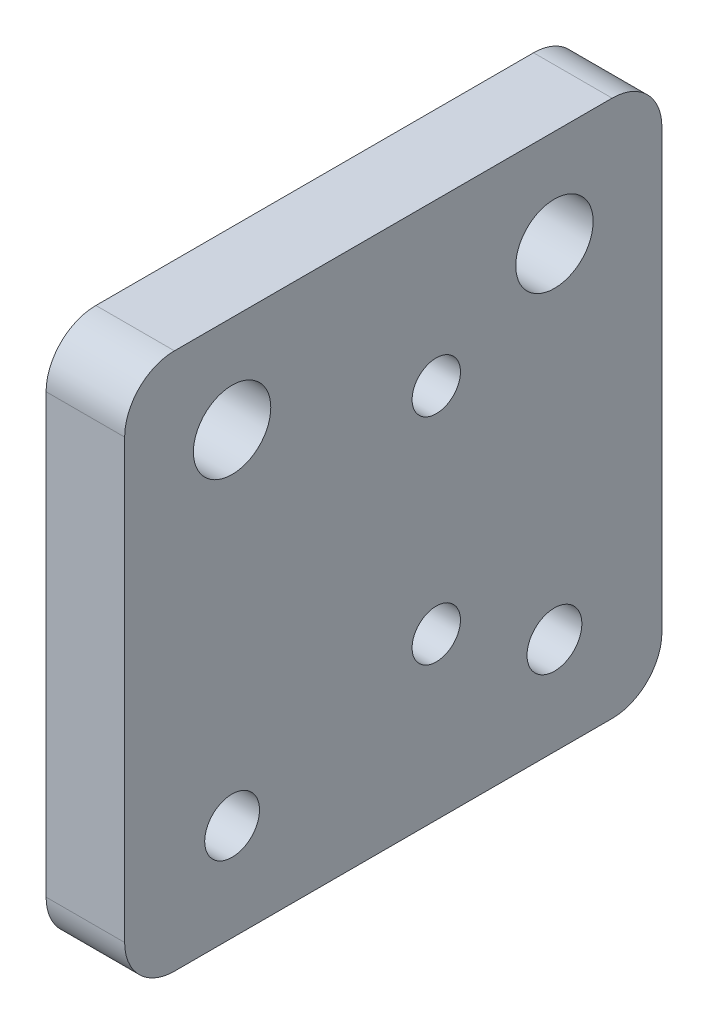
ISO-10303-21;
HEADER;
FILE_DESCRIPTION(('STEP AP214'),'2;1');
FILE_NAME('part.step','',(''),(''),'','','');
FILE_SCHEMA(('AUTOMOTIVE_DESIGN { 1 0 10303 214 1 1 1 1 }'));
ENDSEC;
DATA;
#1=APPLICATION_CONTEXT('core data for automotive mechanical design processes');
#2=APPLICATION_PROTOCOL_DEFINITION('international standard','automotive_design',2000,#1);
#3=PRODUCT_CONTEXT('',#1,'mechanical');
#4=PRODUCT('Part','Part','',(#3));
#5=PRODUCT_RELATED_PRODUCT_CATEGORY('part','',(#4));
#6=PRODUCT_DEFINITION_FORMATION('','',#4);
#7=PRODUCT_DEFINITION_CONTEXT('part definition',#1,'design');
#8=PRODUCT_DEFINITION('design','',#6,#7);
#9=PRODUCT_DEFINITION_SHAPE('','',#8);
#10=(LENGTH_UNIT() NAMED_UNIT(*) SI_UNIT(.MILLI.,.METRE.));
#11=(NAMED_UNIT(*) PLANE_ANGLE_UNIT() SI_UNIT($,.RADIAN.));
#12=(NAMED_UNIT(*) SI_UNIT($,.STERADIAN.) SOLID_ANGLE_UNIT());
#13=UNCERTAINTY_MEASURE_WITH_UNIT(LENGTH_MEASURE(1.E-05),#10,'distance_accuracy_value','');
#14=(GEOMETRIC_REPRESENTATION_CONTEXT(3) GLOBAL_UNCERTAINTY_ASSIGNED_CONTEXT((#13)) GLOBAL_UNIT_ASSIGNED_CONTEXT((#10,
#11,#12)) REPRESENTATION_CONTEXT('',''));
#15=CARTESIAN_POINT('',(0.,0.,0.));
#16=DIRECTION('',(0.,0.,1.));
#17=DIRECTION('',(1.,0.,0.));
#18=AXIS2_PLACEMENT_3D('',#15,#16,#17);
#19=CARTESIAN_POINT('',(7.31,15.95,15.));
#20=DIRECTION('',(-1.,0.,0.));
#21=DIRECTION('',(0.,0.,1.));
#22=AXIS2_PLACEMENT_3D('',#19,#20,#21);
#23=CYLINDRICAL_SURFACE('',#22,3.6);
#24=CARTESIAN_POINT('',(7.31,15.95,15.));
#25=DIRECTION('',(1.,0.,0.));
#26=DIRECTION('',(0.,0.,-1.));
#27=AXIS2_PLACEMENT_3D('',#24,#25,#26);
#28=CIRCLE('',#27,3.6);
#29=CARTESIAN_POINT('',(7.31,15.95,11.4));
#30=VERTEX_POINT('',#29);
#31=EDGE_CURVE('E130',#30,#30,#28,.T.);
#32=ORIENTED_EDGE('',*,*,#31,.T.);
#33=EDGE_LOOP('',(#32));
#34=FACE_BOUND('',#33,.T.);
#35=CARTESIAN_POINT('',(2.,15.95,15.));
#36=DIRECTION('',(-1.,0.,0.));
#37=DIRECTION('',(0.,0.,1.));
#38=AXIS2_PLACEMENT_3D('',#35,#36,#37);
#39=CIRCLE('',#38,3.6);
#40=CARTESIAN_POINT('',(2.,15.95,18.6));
#41=VERTEX_POINT('',#40);
#42=EDGE_CURVE('E157',#41,#41,#39,.T.);
#43=ORIENTED_EDGE('',*,*,#42,.T.);
#44=EDGE_LOOP('',(#43));
#45=FACE_BOUND('',#44,.T.);
#46=ADVANCED_FACE('F35',(#34,#45),#23,.F.);
#47=CARTESIAN_POINT('',(7.31,-15.95,15.));
#48=DIRECTION('',(-1.,0.,0.));
#49=DIRECTION('',(0.,0.,1.));
#50=AXIS2_PLACEMENT_3D('',#47,#48,#49);
#51=CYLINDRICAL_SURFACE('',#50,2.55);
#52=CARTESIAN_POINT('',(7.31,-15.95,15.));
#53=DIRECTION('',(1.,0.,0.));
#54=DIRECTION('',(0.,0.,-1.));
#55=AXIS2_PLACEMENT_3D('',#52,#53,#54);
#56=CIRCLE('',#55,2.55);
#57=CARTESIAN_POINT('',(7.31,-15.95,12.45));
#58=VERTEX_POINT('',#57);
#59=EDGE_CURVE('E204',#58,#58,#56,.T.);
#60=ORIENTED_EDGE('',*,*,#59,.T.);
#61=EDGE_LOOP('',(#60));
#62=FACE_BOUND('',#61,.T.);
#63=CARTESIAN_POINT('',(2.,-15.95,15.));
#64=DIRECTION('',(-1.,0.,0.));
#65=DIRECTION('',(0.,0.,1.));
#66=AXIS2_PLACEMENT_3D('',#63,#64,#65);
#67=CIRCLE('',#66,2.55);
#68=CARTESIAN_POINT('',(2.,-15.95,17.55));
#69=VERTEX_POINT('',#68);
#70=EDGE_CURVE('E153',#69,#69,#67,.T.);
#71=ORIENTED_EDGE('',*,*,#70,.T.);
#72=EDGE_LOOP('',(#71));
#73=FACE_BOUND('',#72,.T.);
#74=ADVANCED_FACE('F260',(#62,#73),#51,.F.);
#75=CARTESIAN_POINT('',(7.31,15.95,-15.));
#76=DIRECTION('',(-1.,0.,0.));
#77=DIRECTION('',(0.,0.,1.));
#78=AXIS2_PLACEMENT_3D('',#75,#76,#77);
#79=CYLINDRICAL_SURFACE('',#78,3.6);
#80=CARTESIAN_POINT('',(7.31,15.95,-15.));
#81=DIRECTION('',(1.,0.,0.));
#82=DIRECTION('',(0.,0.,-1.));
#83=AXIS2_PLACEMENT_3D('',#80,#81,#82);
#84=CIRCLE('',#83,3.6);
#85=CARTESIAN_POINT('',(7.31,15.95,-18.6));
#86=VERTEX_POINT('',#85);
#87=EDGE_CURVE('E136',#86,#86,#84,.T.);
#88=ORIENTED_EDGE('',*,*,#87,.T.);
#89=EDGE_LOOP('',(#88));
#90=FACE_BOUND('',#89,.T.);
#91=CARTESIAN_POINT('',(2.,15.95,-15.));
#92=DIRECTION('',(-1.,0.,0.));
#93=DIRECTION('',(0.,0.,1.));
#94=AXIS2_PLACEMENT_3D('',#91,#92,#93);
#95=CIRCLE('',#94,3.6);
#96=CARTESIAN_POINT('',(2.,15.95,-11.4));
#97=VERTEX_POINT('',#96);
#98=EDGE_CURVE('E150',#97,#97,#95,.T.);
#99=ORIENTED_EDGE('',*,*,#98,.T.);
#100=EDGE_LOOP('',(#99));
#101=FACE_BOUND('',#100,.T.);
#102=ADVANCED_FACE('F297',(#90,#101),#79,.F.);
#103=CARTESIAN_POINT('',(7.31,-15.95,-15.));
#104=DIRECTION('',(-1.,0.,0.));
#105=DIRECTION('',(0.,0.,1.));
#106=AXIS2_PLACEMENT_3D('',#103,#104,#105);
#107=CYLINDRICAL_SURFACE('',#106,2.55);
#108=CARTESIAN_POINT('',(7.31,-15.95,-15.));
#109=DIRECTION('',(1.,0.,0.));
#110=DIRECTION('',(0.,0.,-1.));
#111=AXIS2_PLACEMENT_3D('',#108,#109,#110);
#112=CIRCLE('',#111,2.55);
#113=CARTESIAN_POINT('',(7.31,-15.95,-17.55));
#114=VERTEX_POINT('',#113);
#115=EDGE_CURVE('E148',#114,#114,#112,.T.);
#116=ORIENTED_EDGE('',*,*,#115,.T.);
#117=EDGE_LOOP('',(#116));
#118=FACE_BOUND('',#117,.T.);
#119=CARTESIAN_POINT('',(2.,-15.95,-15.));
#120=DIRECTION('',(-1.,0.,0.));
#121=DIRECTION('',(0.,0.,1.));
#122=AXIS2_PLACEMENT_3D('',#119,#120,#121);
#123=CIRCLE('',#122,2.55);
#124=CARTESIAN_POINT('',(2.,-15.95,-12.45));
#125=VERTEX_POINT('',#124);
#126=EDGE_CURVE('E145',#125,#125,#123,.T.);
#127=ORIENTED_EDGE('',*,*,#126,.T.);
#128=EDGE_LOOP('',(#127));
#129=FACE_BOUND('',#128,.T.);
#130=ADVANCED_FACE('F300',(#118,#129),#107,.F.);
#131=CARTESIAN_POINT('',(7.31,-25.,-25.));
#132=DIRECTION('',(0.,0.,1.));
#133=DIRECTION('',(1.,0.,0.));
#134=AXIS2_PLACEMENT_3D('',#131,#132,#133);
#135=PLANE('',#134);
#136=DIRECTION('',(0.,1.,0.));
#137=VECTOR('',#136,1.);
#138=CARTESIAN_POINT('',(7.31,-25.,-25.));
#139=LINE('',#138,#137);
#140=CARTESIAN_POINT('',(7.31,-20.365,-25.));
#141=VERTEX_POINT('',#140);
#142=CARTESIAN_POINT('',(7.31,20.365,-25.));
#143=VERTEX_POINT('',#142);
#144=EDGE_CURVE('E122',#141,#143,#139,.T.);
#145=ORIENTED_EDGE('',*,*,#144,.F.);
#146=DIRECTION('',(-1.,0.,0.));
#147=VECTOR('',#146,1.);
#148=CARTESIAN_POINT('',(7.31,-20.365,-25.));
#149=LINE('',#148,#147);
#150=CARTESIAN_POINT('',(0.,-20.365,-25.));
#151=VERTEX_POINT('',#150);
#152=EDGE_CURVE('E106',#141,#151,#149,.T.);
#153=ORIENTED_EDGE('',*,*,#152,.T.);
#154=DIRECTION('',(0.,1.,0.));
#155=VECTOR('',#154,1.);
#156=CARTESIAN_POINT('',(0.,-25.,-25.));
#157=LINE('',#156,#155);
#158=CARTESIAN_POINT('',(0.,20.365,-25.));
#159=VERTEX_POINT('',#158);
#160=EDGE_CURVE('E119',#151,#159,#157,.T.);
#161=ORIENTED_EDGE('',*,*,#160,.T.);
#162=DIRECTION('',(-1.,0.,0.));
#163=VECTOR('',#162,1.);
#164=CARTESIAN_POINT('',(7.31,20.365,-25.));
#165=LINE('',#164,#163);
#166=EDGE_CURVE('E124',#159,#143,#165,.F.);
#167=ORIENTED_EDGE('',*,*,#166,.T.);
#168=EDGE_LOOP('',(#145,#153,#161,#167));
#169=FACE_BOUND('',#168,.T.);
#170=ADVANCED_FACE('F118',(#169),#135,.F.);
#171=CARTESIAN_POINT('',(7.31,25.,25.));
#172=DIRECTION('',(0.,-1.,0.));
#173=DIRECTION('',(0.,0.,-1.));
#174=AXIS2_PLACEMENT_3D('',#171,#172,#173);
#175=PLANE('',#174);
#176=DIRECTION('',(0.,0.,1.));
#177=VECTOR('',#176,1.);
#178=CARTESIAN_POINT('',(7.31,25.,25.));
#179=LINE('',#178,#177);
#180=CARTESIAN_POINT('',(7.31,25.,-20.365));
#181=VERTEX_POINT('',#180);
#182=CARTESIAN_POINT('',(7.31,25.,20.365));
#183=VERTEX_POINT('',#182);
#184=EDGE_CURVE('E182',#181,#183,#179,.T.);
#185=ORIENTED_EDGE('',*,*,#184,.F.);
#186=DIRECTION('',(-1.,0.,0.));
#187=VECTOR('',#186,1.);
#188=CARTESIAN_POINT('',(7.31,25.,-20.365));
#189=LINE('',#188,#187);
#190=CARTESIAN_POINT('',(0.,25.,-20.365));
#191=VERTEX_POINT('',#190);
#192=EDGE_CURVE('E11',#181,#191,#189,.T.);
#193=ORIENTED_EDGE('',*,*,#192,.T.);
#194=DIRECTION('',(0.,0.,1.));
#195=VECTOR('',#194,1.);
#196=CARTESIAN_POINT('',(0.,25.,25.));
#197=LINE('',#196,#195);
#198=CARTESIAN_POINT('',(0.,25.,20.365));
#199=VERTEX_POINT('',#198);
#200=EDGE_CURVE('E129',#191,#199,#197,.T.);
#201=ORIENTED_EDGE('',*,*,#200,.T.);
#202=DIRECTION('',(-1.,0.,0.));
#203=VECTOR('',#202,1.);
#204=CARTESIAN_POINT('',(7.31,25.,20.365));
#205=LINE('',#204,#203);
#206=EDGE_CURVE('E43',#199,#183,#205,.F.);
#207=ORIENTED_EDGE('',*,*,#206,.T.);
#208=EDGE_LOOP('',(#185,#193,#201,#207));
#209=FACE_BOUND('',#208,.T.);
#210=ADVANCED_FACE('F181',(#209),#175,.F.);
#211=CARTESIAN_POINT('',(7.31,-25.,25.));
#212=DIRECTION('',(0.,0.,-1.));
#213=DIRECTION('',(-1.,0.,0.));
#214=AXIS2_PLACEMENT_3D('',#211,#212,#213);
#215=PLANE('',#214);
#216=DIRECTION('',(0.,-1.,0.));
#217=VECTOR('',#216,1.);
#218=CARTESIAN_POINT('',(0.,-25.,25.));
#219=LINE('',#218,#217);
#220=CARTESIAN_POINT('',(0.,20.365,25.));
#221=VERTEX_POINT('',#220);
#222=CARTESIAN_POINT('',(0.,-20.365,25.));
#223=VERTEX_POINT('',#222);
#224=EDGE_CURVE('E133',#221,#223,#219,.T.);
#225=ORIENTED_EDGE('',*,*,#224,.T.);
#226=DIRECTION('',(-1.,0.,0.));
#227=VECTOR('',#226,1.);
#228=CARTESIAN_POINT('',(7.31,-20.365,25.));
#229=LINE('',#228,#227);
#230=CARTESIAN_POINT('',(7.31,-20.365,25.));
#231=VERTEX_POINT('',#230);
#232=EDGE_CURVE('E50',#223,#231,#229,.F.);
#233=ORIENTED_EDGE('',*,*,#232,.T.);
#234=DIRECTION('',(0.,-1.,0.));
#235=VECTOR('',#234,1.);
#236=CARTESIAN_POINT('',(7.31,-25.,25.));
#237=LINE('',#236,#235);
#238=CARTESIAN_POINT('',(7.31,20.365,25.));
#239=VERTEX_POINT('',#238);
#240=EDGE_CURVE('E188',#239,#231,#237,.T.);
#241=ORIENTED_EDGE('',*,*,#240,.F.);
#242=DIRECTION('',(-1.,0.,0.));
#243=VECTOR('',#242,1.);
#244=CARTESIAN_POINT('',(7.31,20.365,25.));
#245=LINE('',#244,#243);
#246=EDGE_CURVE('E175',#239,#221,#245,.T.);
#247=ORIENTED_EDGE('',*,*,#246,.T.);
#248=EDGE_LOOP('',(#225,#233,#241,#247));
#249=FACE_BOUND('',#248,.T.);
#250=ADVANCED_FACE('F192',(#249),#215,.F.);
#251=CARTESIAN_POINT('',(7.31,-25.,25.));
#252=DIRECTION('',(0.,1.,0.));
#253=DIRECTION('',(0.,0.,1.));
#254=AXIS2_PLACEMENT_3D('',#251,#252,#253);
#255=PLANE('',#254);
#256=DIRECTION('',(0.,0.,-1.));
#257=VECTOR('',#256,1.);
#258=CARTESIAN_POINT('',(0.,-25.,25.));
#259=LINE('',#258,#257);
#260=CARTESIAN_POINT('',(0.,-25.,20.365));
#261=VERTEX_POINT('',#260);
#262=CARTESIAN_POINT('',(0.,-25.,-20.365));
#263=VERTEX_POINT('',#262);
#264=EDGE_CURVE('E143',#261,#263,#259,.T.);
#265=ORIENTED_EDGE('',*,*,#264,.T.);
#266=DIRECTION('',(-1.,0.,0.));
#267=VECTOR('',#266,1.);
#268=CARTESIAN_POINT('',(7.31,-25.,-20.365));
#269=LINE('',#268,#267);
#270=CARTESIAN_POINT('',(7.31,-25.,-20.365));
#271=VERTEX_POINT('',#270);
#272=EDGE_CURVE('E107',#263,#271,#269,.F.);
#273=ORIENTED_EDGE('',*,*,#272,.T.);
#274=DIRECTION('',(0.,0.,-1.));
#275=VECTOR('',#274,1.);
#276=CARTESIAN_POINT('',(7.31,-25.,25.));
#277=LINE('',#276,#275);
#278=CARTESIAN_POINT('',(7.31,-25.,20.365));
#279=VERTEX_POINT('',#278);
#280=EDGE_CURVE('E139',#279,#271,#277,.T.);
#281=ORIENTED_EDGE('',*,*,#280,.F.);
#282=DIRECTION('',(-1.,0.,0.));
#283=VECTOR('',#282,1.);
#284=CARTESIAN_POINT('',(7.31,-25.,20.365));
#285=LINE('',#284,#283);
#286=EDGE_CURVE('E112',#279,#261,#285,.T.);
#287=ORIENTED_EDGE('',*,*,#286,.T.);
#288=EDGE_LOOP('',(#265,#273,#281,#287));
#289=FACE_BOUND('',#288,.T.);
#290=ADVANCED_FACE('F199',(#289),#255,.F.);
#291=CARTESIAN_POINT('',(7.31,0.,0.));
#292=DIRECTION('',(-1.,0.,0.));
#293=DIRECTION('',(0.,0.,1.));
#294=AXIS2_PLACEMENT_3D('',#291,#292,#293);
#295=PLANE('',#294);
#296=CARTESIAN_POINT('',(7.31,-10.,-4.));
#297=DIRECTION('',(1.,0.,0.));
#298=DIRECTION('',(0.,0.,-1.));
#299=AXIS2_PLACEMENT_3D('',#296,#297,#298);
#300=CIRCLE('',#299,2.25);
#301=CARTESIAN_POINT('',(7.31,-10.,-6.25));
#302=VERTEX_POINT('',#301);
#303=EDGE_CURVE('E239',#302,#302,#300,.T.);
#304=ORIENTED_EDGE('',*,*,#303,.F.);
#305=EDGE_LOOP('',(#304));
#306=FACE_BOUND('',#305,.T.);
#307=CARTESIAN_POINT('',(7.31,10.,-4.));
#308=DIRECTION('',(1.,0.,0.));
#309=DIRECTION('',(0.,0.,-1.));
#310=AXIS2_PLACEMENT_3D('',#307,#308,#309);
#311=CIRCLE('',#310,2.25);
#312=CARTESIAN_POINT('',(7.31,10.,-6.25));
#313=VERTEX_POINT('',#312);
#314=EDGE_CURVE('E233',#313,#313,#311,.T.);
#315=ORIENTED_EDGE('',*,*,#314,.F.);
#316=EDGE_LOOP('',(#315));
#317=FACE_BOUND('',#316,.T.);
#318=ORIENTED_EDGE('',*,*,#87,.F.);
#319=EDGE_LOOP('',(#318));
#320=FACE_BOUND('',#319,.T.);
#321=ORIENTED_EDGE('',*,*,#59,.F.);
#322=EDGE_LOOP('',(#321));
#323=FACE_BOUND('',#322,.T.);
#324=ORIENTED_EDGE('',*,*,#115,.F.);
#325=EDGE_LOOP('',(#324));
#326=FACE_BOUND('',#325,.T.);
#327=ORIENTED_EDGE('',*,*,#31,.F.);
#328=EDGE_LOOP('',(#327));
#329=FACE_BOUND('',#328,.T.);
#330=ORIENTED_EDGE('',*,*,#280,.T.);
#331=CARTESIAN_POINT('',(7.31,-20.365,-20.365));
#332=DIRECTION('',(-1.,0.,0.));
#333=DIRECTION('',(0.,0.,1.));
#334=AXIS2_PLACEMENT_3D('',#331,#332,#333);
#335=CIRCLE('',#334,4.635);
#336=EDGE_CURVE('E173',#271,#141,#335,.F.);
#337=ORIENTED_EDGE('',*,*,#336,.T.);
#338=ORIENTED_EDGE('',*,*,#144,.T.);
#339=CARTESIAN_POINT('',(7.31,20.365,-20.365));
#340=DIRECTION('',(-1.,0.,0.));
#341=DIRECTION('',(0.,0.,1.));
#342=AXIS2_PLACEMENT_3D('',#339,#340,#341);
#343=CIRCLE('',#342,4.635);
#344=EDGE_CURVE('E169',#143,#181,#343,.F.);
#345=ORIENTED_EDGE('',*,*,#344,.T.);
#346=ORIENTED_EDGE('',*,*,#184,.T.);
#347=CARTESIAN_POINT('',(7.31,20.365,20.365));
#348=DIRECTION('',(-1.,0.,0.));
#349=DIRECTION('',(0.,0.,1.));
#350=AXIS2_PLACEMENT_3D('',#347,#348,#349);
#351=CIRCLE('',#350,4.635);
#352=EDGE_CURVE('E57',#183,#239,#351,.F.);
#353=ORIENTED_EDGE('',*,*,#352,.T.);
#354=ORIENTED_EDGE('',*,*,#240,.T.);
#355=CARTESIAN_POINT('',(7.31,-20.365,20.365));
#356=DIRECTION('',(-1.,0.,0.));
#357=DIRECTION('',(0.,0.,1.));
#358=AXIS2_PLACEMENT_3D('',#355,#356,#357);
#359=CIRCLE('',#358,4.635);
#360=EDGE_CURVE('E171',#231,#279,#359,.F.);
#361=ORIENTED_EDGE('',*,*,#360,.T.);
#362=EDGE_LOOP('',(#330,#337,#338,#345,#346,#353,#354,#361));
#363=FACE_BOUND('',#362,.T.);
#364=ADVANCED_FACE('F186',(#306,#317,#320,#323,#326,#329,#363),#295,.F.);
#365=CARTESIAN_POINT('',(0.,0.,0.));
#366=DIRECTION('',(-1.,0.,0.));
#367=DIRECTION('',(0.,0.,1.));
#368=AXIS2_PLACEMENT_3D('',#365,#366,#367);
#369=PLANE('',#368);
#370=CARTESIAN_POINT('',(0.,-10.,-4.));
#371=DIRECTION('',(1.,0.,0.));
#372=DIRECTION('',(0.,0.,-1.));
#373=AXIS2_PLACEMENT_3D('',#370,#371,#372);
#374=CIRCLE('',#373,2.25);
#375=CARTESIAN_POINT('',(0.,-10.,-6.25));
#376=VERTEX_POINT('',#375);
#377=EDGE_CURVE('E236',#376,#376,#374,.T.);
#378=ORIENTED_EDGE('',*,*,#377,.T.);
#379=EDGE_LOOP('',(#378));
#380=FACE_BOUND('',#379,.T.);
#381=CARTESIAN_POINT('',(0.,10.,-4.));
#382=DIRECTION('',(1.,0.,0.));
#383=DIRECTION('',(0.,0.,-1.));
#384=AXIS2_PLACEMENT_3D('',#381,#382,#383);
#385=CIRCLE('',#384,2.25);
#386=CARTESIAN_POINT('',(0.,10.,-6.25));
#387=VERTEX_POINT('',#386);
#388=EDGE_CURVE('E217',#387,#387,#385,.T.);
#389=ORIENTED_EDGE('',*,*,#388,.T.);
#390=EDGE_LOOP('',(#389));
#391=FACE_BOUND('',#390,.T.);
#392=CARTESIAN_POINT('',(0.,-15.95,15.));
#393=DIRECTION('',(-1.,0.,0.));
#394=DIRECTION('',(0.,0.,1.));
#395=AXIS2_PLACEMENT_3D('',#392,#393,#394);
#396=CIRCLE('',#395,5.05);
#397=CARTESIAN_POINT('',(0.,-15.95,20.05));
#398=VERTEX_POINT('',#397);
#399=EDGE_CURVE('E226',#398,#398,#396,.T.);
#400=ORIENTED_EDGE('',*,*,#399,.F.);
#401=EDGE_LOOP('',(#400));
#402=FACE_BOUND('',#401,.T.);
#403=CARTESIAN_POINT('',(0.,15.95,-15.));
#404=DIRECTION('',(-1.,0.,0.));
#405=DIRECTION('',(0.,0.,1.));
#406=AXIS2_PLACEMENT_3D('',#403,#404,#405);
#407=CIRCLE('',#406,6.);
#408=CARTESIAN_POINT('',(0.,15.95,-9.));
#409=VERTEX_POINT('',#408);
#410=EDGE_CURVE('E220',#409,#409,#407,.T.);
#411=ORIENTED_EDGE('',*,*,#410,.F.);
#412=EDGE_LOOP('',(#411));
#413=FACE_BOUND('',#412,.T.);
#414=CARTESIAN_POINT('',(0.,15.95,15.));
#415=DIRECTION('',(-1.,0.,0.));
#416=DIRECTION('',(0.,0.,1.));
#417=AXIS2_PLACEMENT_3D('',#414,#415,#416);
#418=CIRCLE('',#417,6.);
#419=CARTESIAN_POINT('',(0.,15.95,21.));
#420=VERTEX_POINT('',#419);
#421=EDGE_CURVE('E213',#420,#420,#418,.T.);
#422=ORIENTED_EDGE('',*,*,#421,.F.);
#423=EDGE_LOOP('',(#422));
#424=FACE_BOUND('',#423,.T.);
#425=CARTESIAN_POINT('',(0.,-15.95,-15.));
#426=DIRECTION('',(-1.,0.,0.));
#427=DIRECTION('',(0.,0.,1.));
#428=AXIS2_PLACEMENT_3D('',#425,#426,#427);
#429=CIRCLE('',#428,5.05);
#430=CARTESIAN_POINT('',(0.,-15.95,-9.95));
#431=VERTEX_POINT('',#430);
#432=EDGE_CURVE('E160',#431,#431,#429,.T.);
#433=ORIENTED_EDGE('',*,*,#432,.F.);
#434=EDGE_LOOP('',(#433));
#435=FACE_BOUND('',#434,.T.);
#436=ORIENTED_EDGE('',*,*,#160,.F.);
#437=CARTESIAN_POINT('',(0.,-20.365,-20.365));
#438=DIRECTION('',(-1.,0.,0.));
#439=DIRECTION('',(0.,0.,1.));
#440=AXIS2_PLACEMENT_3D('',#437,#438,#439);
#441=CIRCLE('',#440,4.635);
#442=EDGE_CURVE('E102',#151,#263,#441,.T.);
#443=ORIENTED_EDGE('',*,*,#442,.T.);
#444=ORIENTED_EDGE('',*,*,#264,.F.);
#445=CARTESIAN_POINT('',(0.,-20.365,20.365));
#446=DIRECTION('',(-1.,0.,0.));
#447=DIRECTION('',(0.,0.,1.));
#448=AXIS2_PLACEMENT_3D('',#445,#446,#447);
#449=CIRCLE('',#448,4.635);
#450=EDGE_CURVE('E113',#261,#223,#449,.T.);
#451=ORIENTED_EDGE('',*,*,#450,.T.);
#452=ORIENTED_EDGE('',*,*,#224,.F.);
#453=CARTESIAN_POINT('',(0.,20.365,20.365));
#454=DIRECTION('',(-1.,0.,0.));
#455=DIRECTION('',(0.,0.,1.));
#456=AXIS2_PLACEMENT_3D('',#453,#454,#455);
#457=CIRCLE('',#456,4.635);
#458=EDGE_CURVE('E123',#221,#199,#457,.T.);
#459=ORIENTED_EDGE('',*,*,#458,.T.);
#460=ORIENTED_EDGE('',*,*,#200,.F.);
#461=CARTESIAN_POINT('',(0.,20.365,-20.365));
#462=DIRECTION('',(-1.,0.,0.));
#463=DIRECTION('',(0.,0.,1.));
#464=AXIS2_PLACEMENT_3D('',#461,#462,#463);
#465=CIRCLE('',#464,4.635);
#466=EDGE_CURVE('E128',#191,#159,#465,.T.);
#467=ORIENTED_EDGE('',*,*,#466,.T.);
#468=EDGE_LOOP('',(#436,#443,#444,#451,#452,#459,#460,#467));
#469=FACE_BOUND('',#468,.T.);
#470=ADVANCED_FACE('F126',(#380,#391,#402,#413,#424,#435,#469),#369,.T.);
#471=CARTESIAN_POINT('',(2.,-15.95,-15.));
#472=DIRECTION('',(-1.,0.,0.));
#473=DIRECTION('',(0.,0.,1.));
#474=AXIS2_PLACEMENT_3D('',#471,#472,#473);
#475=CYLINDRICAL_SURFACE('',#474,5.05);
#476=CARTESIAN_POINT('',(2.,-15.95,-15.));
#477=DIRECTION('',(-1.,0.,0.));
#478=DIRECTION('',(0.,0.,1.));
#479=AXIS2_PLACEMENT_3D('',#476,#477,#478);
#480=CIRCLE('',#479,5.05);
#481=CARTESIAN_POINT('',(2.,-15.95,-9.95));
#482=VERTEX_POINT('',#481);
#483=EDGE_CURVE('E149',#482,#482,#480,.T.);
#484=ORIENTED_EDGE('',*,*,#483,.F.);
#485=EDGE_LOOP('',(#484));
#486=FACE_BOUND('',#485,.T.);
#487=ORIENTED_EDGE('',*,*,#432,.T.);
#488=EDGE_LOOP('',(#487));
#489=FACE_BOUND('',#488,.T.);
#490=ADVANCED_FACE('F280',(#486,#489),#475,.F.);
#491=CARTESIAN_POINT('',(2.,-15.95,-15.));
#492=DIRECTION('',(-1.,0.,0.));
#493=DIRECTION('',(0.,0.,1.));
#494=AXIS2_PLACEMENT_3D('',#491,#492,#493);
#495=PLANE('',#494);
#496=ORIENTED_EDGE('',*,*,#126,.F.);
#497=EDGE_LOOP('',(#496));
#498=FACE_BOUND('',#497,.T.);
#499=ORIENTED_EDGE('',*,*,#483,.T.);
#500=EDGE_LOOP('',(#499));
#501=FACE_BOUND('',#500,.T.);
#502=ADVANCED_FACE('F286',(#498,#501),#495,.T.);
#503=CARTESIAN_POINT('',(2.,15.95,-15.));
#504=DIRECTION('',(-1.,0.,0.));
#505=DIRECTION('',(0.,0.,1.));
#506=AXIS2_PLACEMENT_3D('',#503,#504,#505);
#507=CYLINDRICAL_SURFACE('',#506,6.);
#508=CARTESIAN_POINT('',(2.,15.95,-15.));
#509=DIRECTION('',(-1.,0.,0.));
#510=DIRECTION('',(0.,0.,1.));
#511=AXIS2_PLACEMENT_3D('',#508,#509,#510);
#512=CIRCLE('',#511,6.);
#513=CARTESIAN_POINT('',(2.,15.95,-9.));
#514=VERTEX_POINT('',#513);
#515=EDGE_CURVE('E223',#514,#514,#512,.T.);
#516=ORIENTED_EDGE('',*,*,#515,.F.);
#517=EDGE_LOOP('',(#516));
#518=FACE_BOUND('',#517,.T.);
#519=ORIENTED_EDGE('',*,*,#410,.T.);
#520=EDGE_LOOP('',(#519));
#521=FACE_BOUND('',#520,.T.);
#522=ADVANCED_FACE('F292',(#518,#521),#507,.F.);
#523=CARTESIAN_POINT('',(2.,15.95,-15.));
#524=DIRECTION('',(-1.,0.,0.));
#525=DIRECTION('',(0.,0.,1.));
#526=AXIS2_PLACEMENT_3D('',#523,#524,#525);
#527=PLANE('',#526);
#528=ORIENTED_EDGE('',*,*,#98,.F.);
#529=EDGE_LOOP('',(#528));
#530=FACE_BOUND('',#529,.T.);
#531=ORIENTED_EDGE('',*,*,#515,.T.);
#532=EDGE_LOOP('',(#531));
#533=FACE_BOUND('',#532,.T.);
#534=ADVANCED_FACE('F429',(#530,#533),#527,.T.);
#535=CARTESIAN_POINT('',(2.,-15.95,15.));
#536=DIRECTION('',(-1.,0.,0.));
#537=DIRECTION('',(0.,0.,1.));
#538=AXIS2_PLACEMENT_3D('',#535,#536,#537);
#539=CYLINDRICAL_SURFACE('',#538,5.05);
#540=CARTESIAN_POINT('',(2.,-15.95,15.));
#541=DIRECTION('',(-1.,0.,0.));
#542=DIRECTION('',(0.,0.,1.));
#543=AXIS2_PLACEMENT_3D('',#540,#541,#542);
#544=CIRCLE('',#543,5.05);
#545=CARTESIAN_POINT('',(2.,-15.95,20.05));
#546=VERTEX_POINT('',#545);
#547=EDGE_CURVE('E154',#546,#546,#544,.T.);
#548=ORIENTED_EDGE('',*,*,#547,.F.);
#549=EDGE_LOOP('',(#548));
#550=FACE_BOUND('',#549,.T.);
#551=ORIENTED_EDGE('',*,*,#399,.T.);
#552=EDGE_LOOP('',(#551));
#553=FACE_BOUND('',#552,.T.);
#554=ADVANCED_FACE('F419',(#550,#553),#539,.F.);
#555=CARTESIAN_POINT('',(2.,-15.95,15.));
#556=DIRECTION('',(-1.,0.,0.));
#557=DIRECTION('',(0.,0.,1.));
#558=AXIS2_PLACEMENT_3D('',#555,#556,#557);
#559=PLANE('',#558);
#560=ORIENTED_EDGE('',*,*,#70,.F.);
#561=EDGE_LOOP('',(#560));
#562=FACE_BOUND('',#561,.T.);
#563=ORIENTED_EDGE('',*,*,#547,.T.);
#564=EDGE_LOOP('',(#563));
#565=FACE_BOUND('',#564,.T.);
#566=ADVANCED_FACE('F274',(#562,#565),#559,.T.);
#567=CARTESIAN_POINT('',(2.,15.95,15.));
#568=DIRECTION('',(-1.,0.,0.));
#569=DIRECTION('',(0.,0.,1.));
#570=AXIS2_PLACEMENT_3D('',#567,#568,#569);
#571=CYLINDRICAL_SURFACE('',#570,6.);
#572=CARTESIAN_POINT('',(2.,15.95,15.));
#573=DIRECTION('',(-1.,0.,0.));
#574=DIRECTION('',(0.,0.,1.));
#575=AXIS2_PLACEMENT_3D('',#572,#573,#574);
#576=CIRCLE('',#575,6.);
#577=CARTESIAN_POINT('',(2.,15.95,21.));
#578=VERTEX_POINT('',#577);
#579=EDGE_CURVE('E216',#578,#578,#576,.T.);
#580=ORIENTED_EDGE('',*,*,#579,.F.);
#581=EDGE_LOOP('',(#580));
#582=FACE_BOUND('',#581,.T.);
#583=ORIENTED_EDGE('',*,*,#421,.T.);
#584=EDGE_LOOP('',(#583));
#585=FACE_BOUND('',#584,.T.);
#586=ADVANCED_FACE('F268',(#582,#585),#571,.F.);
#587=CARTESIAN_POINT('',(2.,15.95,15.));
#588=DIRECTION('',(-1.,0.,0.));
#589=DIRECTION('',(0.,0.,1.));
#590=AXIS2_PLACEMENT_3D('',#587,#588,#589);
#591=PLANE('',#590);
#592=ORIENTED_EDGE('',*,*,#42,.F.);
#593=EDGE_LOOP('',(#592));
#594=FACE_BOUND('',#593,.T.);
#595=ORIENTED_EDGE('',*,*,#579,.T.);
#596=EDGE_LOOP('',(#595));
#597=FACE_BOUND('',#596,.T.);
#598=ADVANCED_FACE('F264',(#594,#597),#591,.T.);
#599=CARTESIAN_POINT('',(7.31,10.,-4.));
#600=DIRECTION('',(1.,0.,0.));
#601=DIRECTION('',(0.,0.,-1.));
#602=AXIS2_PLACEMENT_3D('',#599,#600,#601);
#603=CYLINDRICAL_SURFACE('',#602,2.25);
#604=ORIENTED_EDGE('',*,*,#388,.F.);
#605=EDGE_LOOP('',(#604));
#606=FACE_BOUND('',#605,.T.);
#607=ORIENTED_EDGE('',*,*,#314,.T.);
#608=EDGE_LOOP('',(#607));
#609=FACE_BOUND('',#608,.T.);
#610=ADVANCED_FACE('F267',(#606,#609),#603,.F.);
#611=CARTESIAN_POINT('',(7.31,-10.,-4.));
#612=DIRECTION('',(1.,0.,0.));
#613=DIRECTION('',(0.,0.,-1.));
#614=AXIS2_PLACEMENT_3D('',#611,#612,#613);
#615=CYLINDRICAL_SURFACE('',#614,2.25);
#616=ORIENTED_EDGE('',*,*,#377,.F.);
#617=EDGE_LOOP('',(#616));
#618=FACE_BOUND('',#617,.T.);
#619=ORIENTED_EDGE('',*,*,#303,.T.);
#620=EDGE_LOOP('',(#619));
#621=FACE_BOUND('',#620,.T.);
#622=ADVANCED_FACE('F243',(#618,#621),#615,.F.);
#623=CARTESIAN_POINT('',(7.31,-20.365,-20.365));
#624=DIRECTION('',(-1.,0.,0.));
#625=DIRECTION('',(0.,0.,1.));
#626=AXIS2_PLACEMENT_3D('',#623,#624,#625);
#627=CYLINDRICAL_SURFACE('',#626,4.635);
#628=ORIENTED_EDGE('',*,*,#336,.F.);
#629=ORIENTED_EDGE('',*,*,#272,.F.);
#630=ORIENTED_EDGE('',*,*,#442,.F.);
#631=ORIENTED_EDGE('',*,*,#152,.F.);
#632=EDGE_LOOP('',(#628,#629,#630,#631));
#633=FACE_BOUND('',#632,.T.);
#634=ADVANCED_FACE('F105',(#633),#627,.T.);
#635=CARTESIAN_POINT('',(7.31,-20.365,20.365));
#636=DIRECTION('',(-1.,0.,0.));
#637=DIRECTION('',(0.,0.,1.));
#638=AXIS2_PLACEMENT_3D('',#635,#636,#637);
#639=CYLINDRICAL_SURFACE('',#638,4.635);
#640=ORIENTED_EDGE('',*,*,#360,.F.);
#641=ORIENTED_EDGE('',*,*,#232,.F.);
#642=ORIENTED_EDGE('',*,*,#450,.F.);
#643=ORIENTED_EDGE('',*,*,#286,.F.);
#644=EDGE_LOOP('',(#640,#641,#642,#643));
#645=FACE_BOUND('',#644,.T.);
#646=ADVANCED_FACE('F196',(#645),#639,.T.);
#647=CARTESIAN_POINT('',(7.31,20.365,-20.365));
#648=DIRECTION('',(-1.,0.,0.));
#649=DIRECTION('',(0.,0.,1.));
#650=AXIS2_PLACEMENT_3D('',#647,#648,#649);
#651=CYLINDRICAL_SURFACE('',#650,4.635);
#652=ORIENTED_EDGE('',*,*,#344,.F.);
#653=ORIENTED_EDGE('',*,*,#166,.F.);
#654=ORIENTED_EDGE('',*,*,#466,.F.);
#655=ORIENTED_EDGE('',*,*,#192,.F.);
#656=EDGE_LOOP('',(#652,#653,#654,#655));
#657=FACE_BOUND('',#656,.T.);
#658=ADVANCED_FACE('F319',(#657),#651,.T.);
#659=CARTESIAN_POINT('',(7.31,20.365,20.365));
#660=DIRECTION('',(-1.,0.,0.));
#661=DIRECTION('',(0.,0.,1.));
#662=AXIS2_PLACEMENT_3D('',#659,#660,#661);
#663=CYLINDRICAL_SURFACE('',#662,4.635);
#664=ORIENTED_EDGE('',*,*,#352,.F.);
#665=ORIENTED_EDGE('',*,*,#206,.F.);
#666=ORIENTED_EDGE('',*,*,#458,.F.);
#667=ORIENTED_EDGE('',*,*,#246,.F.);
#668=EDGE_LOOP('',(#664,#665,#666,#667));
#669=FACE_BOUND('',#668,.T.);
#670=ADVANCED_FACE('F37',(#669),#663,.T.);
#671=CLOSED_SHELL('',(#46,#74,#102,#130,#170,#210,#250,#290,#364,#470,#490,#502,#522,#534,#554,
#566,#586,#598,#610,#622,#634,#646,#658,#670));
#672=MANIFOLD_SOLID_BREP('B2',#671);
#673=ADVANCED_BREP_SHAPE_REPRESENTATION('',(#18,#672),#14);
#674=SHAPE_DEFINITION_REPRESENTATION(#9,#673);
ENDSEC;
END-ISO-10303-21;
